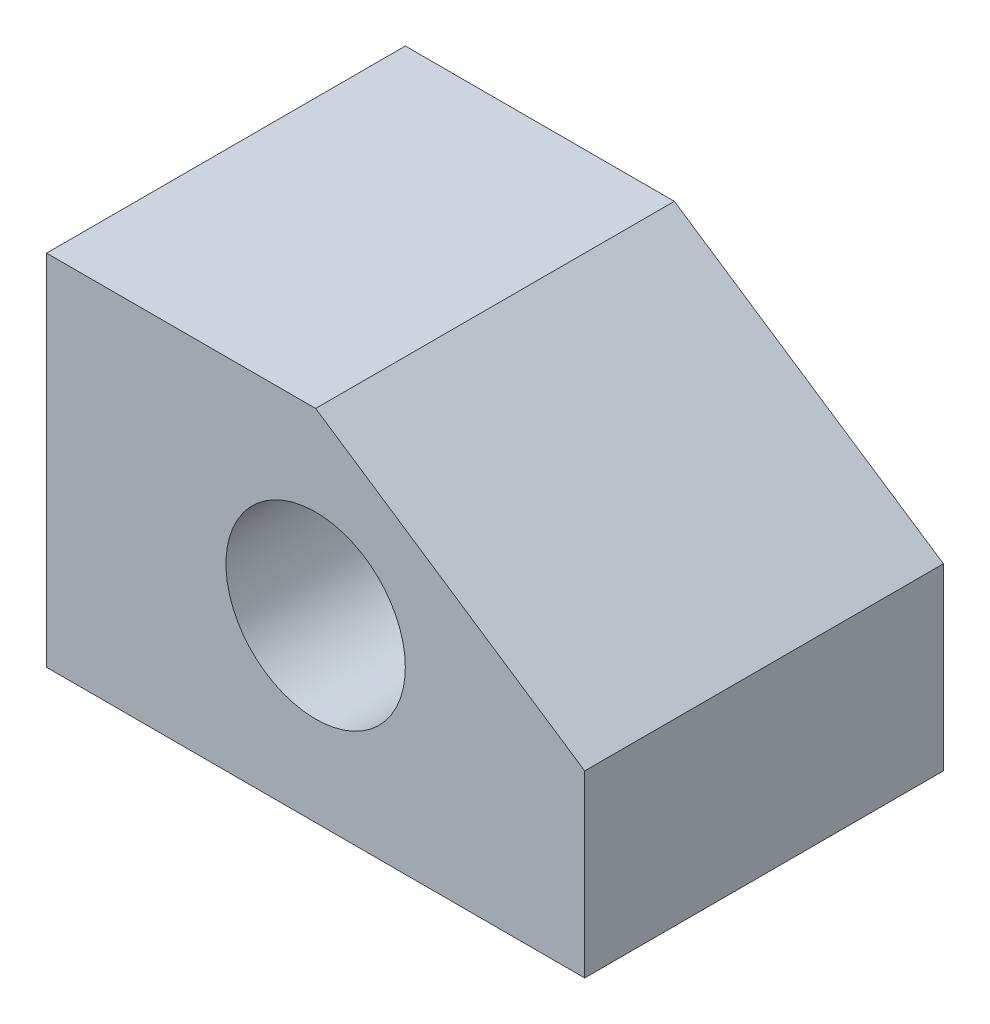
ISO-10303-21;
HEADER;
FILE_DESCRIPTION(('STEP AP214'),'2;1');
FILE_NAME('part.step','',(''),(''),'','','');
FILE_SCHEMA(('AUTOMOTIVE_DESIGN { 1 0 10303 214 1 1 1 1 }'));
ENDSEC;
DATA;
#1=APPLICATION_CONTEXT('core data for automotive mechanical design processes');
#2=APPLICATION_PROTOCOL_DEFINITION('international standard','automotive_design',2000,#1);
#3=PRODUCT_CONTEXT('',#1,'mechanical');
#4=PRODUCT('Part','Part','',(#3));
#5=PRODUCT_RELATED_PRODUCT_CATEGORY('part','',(#4));
#6=PRODUCT_DEFINITION_FORMATION('','',#4);
#7=PRODUCT_DEFINITION_CONTEXT('part definition',#1,'design');
#8=PRODUCT_DEFINITION('design','',#6,#7);
#9=PRODUCT_DEFINITION_SHAPE('','',#8);
#10=(LENGTH_UNIT() NAMED_UNIT(*) SI_UNIT(.MILLI.,.METRE.));
#11=(NAMED_UNIT(*) PLANE_ANGLE_UNIT() SI_UNIT($,.RADIAN.));
#12=(NAMED_UNIT(*) SI_UNIT($,.STERADIAN.) SOLID_ANGLE_UNIT());
#13=UNCERTAINTY_MEASURE_WITH_UNIT(LENGTH_MEASURE(1.E-05),#10,'distance_accuracy_value','');
#14=(GEOMETRIC_REPRESENTATION_CONTEXT(3) GLOBAL_UNCERTAINTY_ASSIGNED_CONTEXT((#13)) GLOBAL_UNIT_ASSIGNED_CONTEXT((#10,
#11,#12)) REPRESENTATION_CONTEXT('',''));
#15=CARTESIAN_POINT('',(0.,0.,0.));
#16=DIRECTION('',(0.,0.,1.));
#17=DIRECTION('',(1.,0.,0.));
#18=AXIS2_PLACEMENT_3D('',#15,#16,#17);
#19=CARTESIAN_POINT('',(0.,0.,-20.));
#20=DIRECTION('',(0.,-1.,0.));
#21=DIRECTION('',(0.,0.,-1.));
#22=AXIS2_PLACEMENT_3D('',#19,#20,#21);
#23=PLANE('',#22);
#24=DIRECTION('',(1.,0.,0.));
#25=VECTOR('',#24,1.);
#26=CARTESIAN_POINT('',(0.,0.,0.));
#27=LINE('',#26,#25);
#28=CARTESIAN_POINT('',(0.,0.,0.));
#29=VERTEX_POINT('',#28);
#30=CARTESIAN_POINT('',(30.,0.,0.));
#31=VERTEX_POINT('',#30);
#32=EDGE_CURVE('E130',#29,#31,#27,.T.);
#33=ORIENTED_EDGE('',*,*,#32,.F.);
#34=DIRECTION('',(0.,0.,1.));
#35=VECTOR('',#34,1.);
#36=CARTESIAN_POINT('',(0.,0.,-20.));
#37=LINE('',#36,#35);
#38=CARTESIAN_POINT('',(0.,0.,-20.));
#39=VERTEX_POINT('',#38);
#40=EDGE_CURVE('E11',#39,#29,#37,.T.);
#41=ORIENTED_EDGE('',*,*,#40,.F.);
#42=DIRECTION('',(1.,0.,0.));
#43=VECTOR('',#42,1.);
#44=CARTESIAN_POINT('',(0.,0.,-20.));
#45=LINE('',#44,#43);
#46=CARTESIAN_POINT('',(30.,0.,-20.));
#47=VERTEX_POINT('',#46);
#48=EDGE_CURVE('E124',#39,#47,#45,.T.);
#49=ORIENTED_EDGE('',*,*,#48,.T.);
#50=DIRECTION('',(0.,0.,1.));
#51=VECTOR('',#50,1.);
#52=CARTESIAN_POINT('',(30.,0.,-20.));
#53=LINE('',#52,#51);
#54=EDGE_CURVE('E48',#47,#31,#53,.T.);
#55=ORIENTED_EDGE('',*,*,#54,.T.);
#56=EDGE_LOOP('',(#33,#41,#49,#55));
#57=FACE_BOUND('',#56,.T.);
#58=ADVANCED_FACE('F45',(#57),#23,.T.);
#59=CARTESIAN_POINT('',(0.,0.,-20.));
#60=DIRECTION('',(1.,0.,0.));
#61=DIRECTION('',(0.,0.,-1.));
#62=AXIS2_PLACEMENT_3D('',#59,#60,#61);
#63=PLANE('',#62);
#64=DIRECTION('',(0.,1.,0.));
#65=VECTOR('',#64,1.);
#66=CARTESIAN_POINT('',(0.,0.,0.));
#67=LINE('',#66,#65);
#68=CARTESIAN_POINT('',(0.,20.,0.));
#69=VERTEX_POINT('',#68);
#70=EDGE_CURVE('E82',#29,#69,#67,.T.);
#71=ORIENTED_EDGE('',*,*,#70,.T.);
#72=DIRECTION('',(0.,0.,1.));
#73=VECTOR('',#72,1.);
#74=CARTESIAN_POINT('',(0.,20.,-20.));
#75=LINE('',#74,#73);
#76=CARTESIAN_POINT('',(0.,20.,-20.));
#77=VERTEX_POINT('',#76);
#78=EDGE_CURVE('E55',#77,#69,#75,.T.);
#79=ORIENTED_EDGE('',*,*,#78,.F.);
#80=DIRECTION('',(0.,1.,0.));
#81=VECTOR('',#80,1.);
#82=CARTESIAN_POINT('',(0.,0.,-20.));
#83=LINE('',#82,#81);
#84=EDGE_CURVE('E104',#39,#77,#83,.T.);
#85=ORIENTED_EDGE('',*,*,#84,.F.);
#86=ORIENTED_EDGE('',*,*,#40,.T.);
#87=EDGE_LOOP('',(#71,#79,#85,#86));
#88=FACE_BOUND('',#87,.T.);
#89=ADVANCED_FACE('F167',(#88),#63,.F.);
#90=CARTESIAN_POINT('',(0.,20.,-20.));
#91=DIRECTION('',(0.,-1.,0.));
#92=DIRECTION('',(0.,0.,-1.));
#93=AXIS2_PLACEMENT_3D('',#90,#91,#92);
#94=PLANE('',#93);
#95=DIRECTION('',(1.,0.,0.));
#96=VECTOR('',#95,1.);
#97=CARTESIAN_POINT('',(0.,20.,0.));
#98=LINE('',#97,#96);
#99=CARTESIAN_POINT('',(15.,20.,0.));
#100=VERTEX_POINT('',#99);
#101=EDGE_CURVE('E112',#69,#100,#98,.T.);
#102=ORIENTED_EDGE('',*,*,#101,.T.);
#103=DIRECTION('',(0.,0.,1.));
#104=VECTOR('',#103,1.);
#105=CARTESIAN_POINT('',(15.,20.,-20.));
#106=LINE('',#105,#104);
#107=CARTESIAN_POINT('',(15.,20.,-20.));
#108=VERTEX_POINT('',#107);
#109=EDGE_CURVE('E109',#108,#100,#106,.T.);
#110=ORIENTED_EDGE('',*,*,#109,.F.);
#111=DIRECTION('',(1.,0.,0.));
#112=VECTOR('',#111,1.);
#113=CARTESIAN_POINT('',(0.,20.,-20.));
#114=LINE('',#113,#112);
#115=EDGE_CURVE('E97',#77,#108,#114,.T.);
#116=ORIENTED_EDGE('',*,*,#115,.F.);
#117=ORIENTED_EDGE('',*,*,#78,.T.);
#118=EDGE_LOOP('',(#102,#110,#116,#117));
#119=FACE_BOUND('',#118,.T.);
#120=ADVANCED_FACE('F110',(#119),#94,.F.);
#121=CARTESIAN_POINT('',(15.,20.,-20.));
#122=DIRECTION('',(-0.554700196225229,-0.832050294337844,0.));
#123=DIRECTION('',(0.832050294337844,-0.554700196225229,0.));
#124=AXIS2_PLACEMENT_3D('',#121,#122,#123);
#125=PLANE('',#124);
#126=DIRECTION('',(0.832050294337844,-0.554700196225229,0.));
#127=VECTOR('',#126,1.);
#128=CARTESIAN_POINT('',(15.,20.,0.));
#129=LINE('',#128,#127);
#130=CARTESIAN_POINT('',(30.,10.,0.));
#131=VERTEX_POINT('',#130);
#132=EDGE_CURVE('E139',#100,#131,#129,.T.);
#133=ORIENTED_EDGE('',*,*,#132,.T.);
#134=DIRECTION('',(0.,0.,1.));
#135=VECTOR('',#134,1.);
#136=CARTESIAN_POINT('',(30.,10.,-20.));
#137=LINE('',#136,#135);
#138=CARTESIAN_POINT('',(30.,10.,-20.));
#139=VERTEX_POINT('',#138);
#140=EDGE_CURVE('E117',#139,#131,#137,.T.);
#141=ORIENTED_EDGE('',*,*,#140,.F.);
#142=DIRECTION('',(0.832050294337844,-0.554700196225229,0.));
#143=VECTOR('',#142,1.);
#144=CARTESIAN_POINT('',(15.,20.,-20.));
#145=LINE('',#144,#143);
#146=EDGE_CURVE('E102',#108,#139,#145,.T.);
#147=ORIENTED_EDGE('',*,*,#146,.F.);
#148=ORIENTED_EDGE('',*,*,#109,.T.);
#149=EDGE_LOOP('',(#133,#141,#147,#148));
#150=FACE_BOUND('',#149,.T.);
#151=ADVANCED_FACE('F119',(#150),#125,.F.);
#152=CARTESIAN_POINT('',(30.,0.,-20.));
#153=DIRECTION('',(1.,0.,0.));
#154=DIRECTION('',(0.,0.,-1.));
#155=AXIS2_PLACEMENT_3D('',#152,#153,#154);
#156=PLANE('',#155);
#157=DIRECTION('',(0.,1.,0.));
#158=VECTOR('',#157,1.);
#159=CARTESIAN_POINT('',(30.,0.,0.));
#160=LINE('',#159,#158);
#161=EDGE_CURVE('E134',#31,#131,#160,.T.);
#162=ORIENTED_EDGE('',*,*,#161,.F.);
#163=ORIENTED_EDGE('',*,*,#54,.F.);
#164=DIRECTION('',(0.,1.,0.));
#165=VECTOR('',#164,1.);
#166=CARTESIAN_POINT('',(30.,0.,-20.));
#167=LINE('',#166,#165);
#168=EDGE_CURVE('E121',#47,#139,#167,.T.);
#169=ORIENTED_EDGE('',*,*,#168,.T.);
#170=ORIENTED_EDGE('',*,*,#140,.T.);
#171=EDGE_LOOP('',(#162,#163,#169,#170));
#172=FACE_BOUND('',#171,.T.);
#173=ADVANCED_FACE('F149',(#172),#156,.T.);
#174=CARTESIAN_POINT('',(0.,0.,-20.));
#175=DIRECTION('',(0.,0.,1.));
#176=DIRECTION('',(1.,0.,0.));
#177=AXIS2_PLACEMENT_3D('',#174,#175,#176);
#178=PLANE('',#177);
#179=CARTESIAN_POINT('',(15.,10.,-20.));
#180=DIRECTION('',(0.,0.,1.));
#181=DIRECTION('',(1.,0.,0.));
#182=AXIS2_PLACEMENT_3D('',#179,#180,#181);
#183=CIRCLE('',#182,5.);
#184=CARTESIAN_POINT('',(20.,10.,-20.));
#185=VERTEX_POINT('',#184);
#186=EDGE_CURVE('E135',#185,#185,#183,.T.);
#187=ORIENTED_EDGE('',*,*,#186,.T.);
#188=EDGE_LOOP('',(#187));
#189=FACE_BOUND('',#188,.T.);
#190=ORIENTED_EDGE('',*,*,#48,.F.);
#191=ORIENTED_EDGE('',*,*,#84,.T.);
#192=ORIENTED_EDGE('',*,*,#115,.T.);
#193=ORIENTED_EDGE('',*,*,#146,.T.);
#194=ORIENTED_EDGE('',*,*,#168,.F.);
#195=EDGE_LOOP('',(#190,#191,#192,#193,#194));
#196=FACE_BOUND('',#195,.T.);
#197=ADVANCED_FACE('F100',(#189,#196),#178,.F.);
#198=CARTESIAN_POINT('',(0.,0.,0.));
#199=DIRECTION('',(0.,0.,1.));
#200=DIRECTION('',(1.,0.,0.));
#201=AXIS2_PLACEMENT_3D('',#198,#199,#200);
#202=PLANE('',#201);
#203=CARTESIAN_POINT('',(15.,10.,0.));
#204=DIRECTION('',(0.,0.,1.));
#205=DIRECTION('',(1.,0.,0.));
#206=AXIS2_PLACEMENT_3D('',#203,#204,#205);
#207=CIRCLE('',#206,5.);
#208=CARTESIAN_POINT('',(20.,10.,0.));
#209=VERTEX_POINT('',#208);
#210=EDGE_CURVE('E221',#209,#209,#207,.T.);
#211=ORIENTED_EDGE('',*,*,#210,.F.);
#212=EDGE_LOOP('',(#211));
#213=FACE_BOUND('',#212,.T.);
#214=ORIENTED_EDGE('',*,*,#32,.T.);
#215=ORIENTED_EDGE('',*,*,#161,.T.);
#216=ORIENTED_EDGE('',*,*,#132,.F.);
#217=ORIENTED_EDGE('',*,*,#101,.F.);
#218=ORIENTED_EDGE('',*,*,#70,.F.);
#219=EDGE_LOOP('',(#214,#215,#216,#217,#218));
#220=FACE_BOUND('',#219,.T.);
#221=ADVANCED_FACE('F151',(#213,#220),#202,.T.);
#222=CARTESIAN_POINT('',(15.,10.,-20.));
#223=DIRECTION('',(0.,0.,1.));
#224=DIRECTION('',(1.,0.,0.));
#225=AXIS2_PLACEMENT_3D('',#222,#223,#224);
#226=CYLINDRICAL_SURFACE('',#225,5.);
#227=ORIENTED_EDGE('',*,*,#186,.F.);
#228=EDGE_LOOP('',(#227));
#229=FACE_BOUND('',#228,.T.);
#230=ORIENTED_EDGE('',*,*,#210,.T.);
#231=EDGE_LOOP('',(#230));
#232=FACE_BOUND('',#231,.T.);
#233=ADVANCED_FACE('F153',(#229,#232),#226,.F.);
#234=CLOSED_SHELL('',(#58,#89,#120,#151,#173,#197,#221,#233));
#235=MANIFOLD_SOLID_BREP('B2',#234);
#236=ADVANCED_BREP_SHAPE_REPRESENTATION('',(#18,#235),#14);
#237=SHAPE_DEFINITION_REPRESENTATION(#9,#236);
ENDSEC;
END-ISO-10303-21;
